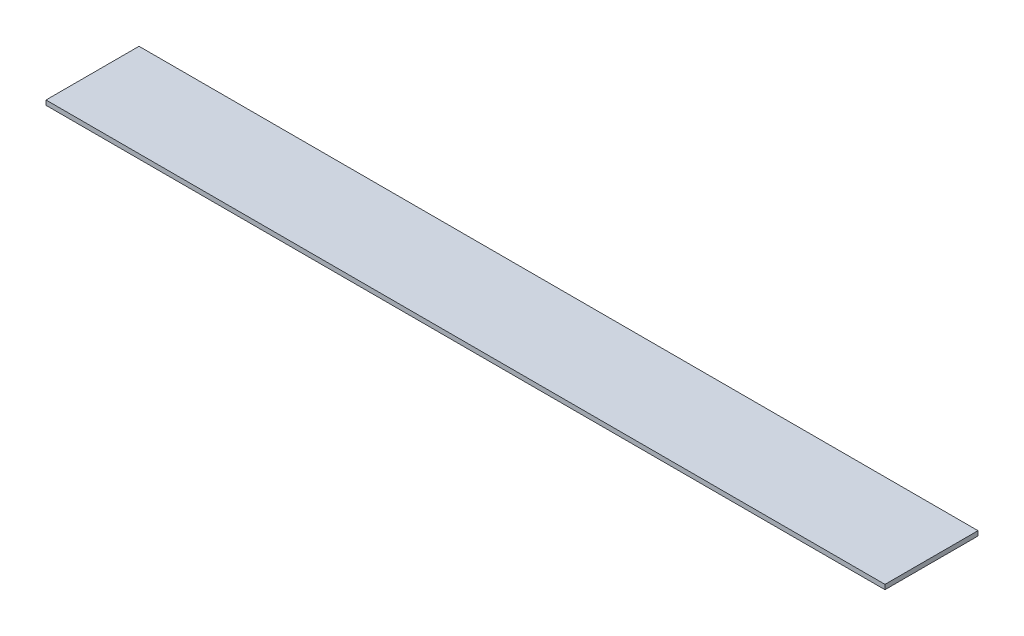
ISO-10303-21;
HEADER;
FILE_DESCRIPTION(('STEP AP214'),'2;1');
FILE_NAME('part.step','',(''),(''),'','','');
FILE_SCHEMA(('AUTOMOTIVE_DESIGN { 1 0 10303 214 1 1 1 1 }'));
ENDSEC;
DATA;
#1=APPLICATION_CONTEXT('core data for automotive mechanical design processes');
#2=APPLICATION_PROTOCOL_DEFINITION('international standard','automotive_design',2000,#1);
#3=PRODUCT_CONTEXT('',#1,'mechanical');
#4=PRODUCT('Part','Part','',(#3));
#5=PRODUCT_RELATED_PRODUCT_CATEGORY('part','',(#4));
#6=PRODUCT_DEFINITION_FORMATION('','',#4);
#7=PRODUCT_DEFINITION_CONTEXT('part definition',#1,'design');
#8=PRODUCT_DEFINITION('design','',#6,#7);
#9=PRODUCT_DEFINITION_SHAPE('','',#8);
#10=(LENGTH_UNIT() NAMED_UNIT(*) SI_UNIT(.MILLI.,.METRE.));
#11=(NAMED_UNIT(*) PLANE_ANGLE_UNIT() SI_UNIT($,.RADIAN.));
#12=(NAMED_UNIT(*) SI_UNIT($,.STERADIAN.) SOLID_ANGLE_UNIT());
#13=UNCERTAINTY_MEASURE_WITH_UNIT(LENGTH_MEASURE(1.E-05),#10,'distance_accuracy_value','');
#14=(GEOMETRIC_REPRESENTATION_CONTEXT(3) GLOBAL_UNCERTAINTY_ASSIGNED_CONTEXT((#13)) GLOBAL_UNIT_ASSIGNED_CONTEXT((#10,
#11,#12)) REPRESENTATION_CONTEXT('',''));
#15=CARTESIAN_POINT('',(0.,0.,0.));
#16=DIRECTION('',(0.,0.,1.));
#17=DIRECTION('',(1.,0.,0.));
#18=AXIS2_PLACEMENT_3D('',#15,#16,#17);
#19=CARTESIAN_POINT('',(-241.153214372562,46.99,0.));
#20=DIRECTION('',(1.,0.,0.));
#21=DIRECTION('',(0.,0.,-1.));
#22=AXIS2_PLACEMENT_3D('',#19,#20,#21);
#23=PLANE('',#22);
#24=DIRECTION('',(0.,1.,0.));
#25=VECTOR('',#24,1.);
#26=CARTESIAN_POINT('',(-241.153214372562,46.99,60.));
#27=LINE('',#26,#25);
#28=CARTESIAN_POINT('',(-241.153214372562,47.,60.));
#29=VERTEX_POINT('',#28);
#30=CARTESIAN_POINT('',(-241.153214372562,50.,60.));
#31=VERTEX_POINT('',#30);
#32=EDGE_CURVE('E38',#29,#31,#27,.T.);
#33=ORIENTED_EDGE('',*,*,#32,.T.);
#34=DIRECTION('',(0.,0.,1.));
#35=VECTOR('',#34,1.);
#36=CARTESIAN_POINT('',(-241.153214372562,50.,60.));
#37=LINE('',#36,#35);
#38=CARTESIAN_POINT('',(-241.153214372562,50.,0.));
#39=VERTEX_POINT('',#38);
#40=EDGE_CURVE('E78',#39,#31,#37,.T.);
#41=ORIENTED_EDGE('',*,*,#40,.F.);
#42=DIRECTION('',(0.,1.,0.));
#43=VECTOR('',#42,1.);
#44=CARTESIAN_POINT('',(-241.153214372562,46.99,0.));
#45=LINE('',#44,#43);
#46=CARTESIAN_POINT('',(-241.153214372562,47.,0.));
#47=VERTEX_POINT('',#46);
#48=EDGE_CURVE('E86',#47,#39,#45,.T.);
#49=ORIENTED_EDGE('',*,*,#48,.F.);
#50=DIRECTION('',(0.,0.,-1.));
#51=VECTOR('',#50,1.);
#52=CARTESIAN_POINT('',(-241.153214372562,47.,3.));
#53=LINE('',#52,#51);
#54=EDGE_CURVE('E87',#29,#47,#53,.T.);
#55=ORIENTED_EDGE('',*,*,#54,.F.);
#56=EDGE_LOOP('',(#33,#41,#49,#55));
#57=FACE_BOUND('',#56,.T.);
#58=ADVANCED_FACE('F34',(#57),#23,.F.);
#59=CARTESIAN_POINT('',(-300.,50.,60.));
#60=DIRECTION('',(0.,-1.,0.));
#61=DIRECTION('',(0.,0.,-1.));
#62=AXIS2_PLACEMENT_3D('',#59,#60,#61);
#63=PLANE('',#62);
#64=DIRECTION('',(-1.,0.,0.));
#65=VECTOR('',#64,1.);
#66=CARTESIAN_POINT('',(-300.,50.,0.));
#67=LINE('',#66,#65);
#68=CARTESIAN_POINT('',(300.,50.,0.));
#69=VERTEX_POINT('',#68);
#70=EDGE_CURVE('E83',#69,#39,#67,.T.);
#71=ORIENTED_EDGE('',*,*,#70,.T.);
#72=ORIENTED_EDGE('',*,*,#40,.T.);
#73=DIRECTION('',(-1.,0.,0.));
#74=VECTOR('',#73,1.);
#75=CARTESIAN_POINT('',(-300.,50.,60.));
#76=LINE('',#75,#74);
#77=CARTESIAN_POINT('',(300.,50.,60.));
#78=VERTEX_POINT('',#77);
#79=EDGE_CURVE('E43',#78,#31,#76,.T.);
#80=ORIENTED_EDGE('',*,*,#79,.F.);
#81=DIRECTION('',(0.,0.,-1.));
#82=VECTOR('',#81,1.);
#83=CARTESIAN_POINT('',(300.,50.,60.));
#84=LINE('',#83,#82);
#85=EDGE_CURVE('E50',#78,#69,#84,.T.);
#86=ORIENTED_EDGE('',*,*,#85,.T.);
#87=EDGE_LOOP('',(#71,#72,#80,#86));
#88=FACE_BOUND('',#87,.T.);
#89=ADVANCED_FACE('F80',(#88),#63,.F.);
#90=CARTESIAN_POINT('',(300.,1.71683972880179E-13,0.));
#91=DIRECTION('',(-1.,0.,0.));
#92=DIRECTION('',(0.,-1.,0.));
#93=AXIS2_PLACEMENT_3D('',#90,#91,#92);
#94=PLANE('',#93);
#95=ORIENTED_EDGE('',*,*,#85,.F.);
#96=DIRECTION('',(0.,-1.,0.));
#97=VECTOR('',#96,1.);
#98=CARTESIAN_POINT('',(300.,3.43367945760358E-13,60.));
#99=LINE('',#98,#97);
#100=CARTESIAN_POINT('',(300.,47.,60.));
#101=VERTEX_POINT('',#100);
#102=EDGE_CURVE('E11',#78,#101,#99,.T.);
#103=ORIENTED_EDGE('',*,*,#102,.T.);
#104=DIRECTION('',(0.,0.,1.));
#105=VECTOR('',#104,1.);
#106=CARTESIAN_POINT('',(300.,47.,3.));
#107=LINE('',#106,#105);
#108=CARTESIAN_POINT('',(300.,47.,0.));
#109=VERTEX_POINT('',#108);
#110=EDGE_CURVE('E58',#109,#101,#107,.T.);
#111=ORIENTED_EDGE('',*,*,#110,.F.);
#112=DIRECTION('',(0.,-1.,0.));
#113=VECTOR('',#112,1.);
#114=CARTESIAN_POINT('',(300.,3.43367945760358E-13,0.));
#115=LINE('',#114,#113);
#116=EDGE_CURVE('E97',#69,#109,#115,.T.);
#117=ORIENTED_EDGE('',*,*,#116,.F.);
#118=EDGE_LOOP('',(#95,#103,#111,#117));
#119=FACE_BOUND('',#118,.T.);
#120=ADVANCED_FACE('F121',(#119),#94,.F.);
#121=CARTESIAN_POINT('',(300.,47.,3.));
#122=DIRECTION('',(0.,1.,0.));
#123=DIRECTION('',(0.,0.,1.));
#124=AXIS2_PLACEMENT_3D('',#121,#122,#123);
#125=PLANE('',#124);
#126=DIRECTION('',(-1.,0.,0.));
#127=VECTOR('',#126,1.);
#128=CARTESIAN_POINT('',(300.,47.,60.));
#129=LINE('',#128,#127);
#130=EDGE_CURVE('E93',#101,#29,#129,.T.);
#131=ORIENTED_EDGE('',*,*,#130,.T.);
#132=ORIENTED_EDGE('',*,*,#54,.T.);
#133=DIRECTION('',(1.,0.,0.));
#134=VECTOR('',#133,1.);
#135=CARTESIAN_POINT('',(-300.,47.,0.));
#136=LINE('',#135,#134);
#137=EDGE_CURVE('E96',#47,#109,#136,.T.);
#138=ORIENTED_EDGE('',*,*,#137,.T.);
#139=ORIENTED_EDGE('',*,*,#110,.T.);
#140=EDGE_LOOP('',(#131,#132,#138,#139));
#141=FACE_BOUND('',#140,.T.);
#142=ADVANCED_FACE('F36',(#141),#125,.F.);
#143=CARTESIAN_POINT('',(-300.,0.,60.));
#144=DIRECTION('',(0.,0.,1.));
#145=DIRECTION('',(1.,0.,0.));
#146=AXIS2_PLACEMENT_3D('',#143,#144,#145);
#147=PLANE('',#146);
#148=ORIENTED_EDGE('',*,*,#32,.F.);
#149=ORIENTED_EDGE('',*,*,#130,.F.);
#150=ORIENTED_EDGE('',*,*,#102,.F.);
#151=ORIENTED_EDGE('',*,*,#79,.T.);
#152=EDGE_LOOP('',(#148,#149,#150,#151));
#153=FACE_BOUND('',#152,.T.);
#154=ADVANCED_FACE('F92',(#153),#147,.T.);
#155=CARTESIAN_POINT('',(-300.,0.,0.));
#156=DIRECTION('',(0.,0.,1.));
#157=DIRECTION('',(1.,0.,0.));
#158=AXIS2_PLACEMENT_3D('',#155,#156,#157);
#159=PLANE('',#158);
#160=ORIENTED_EDGE('',*,*,#137,.F.);
#161=ORIENTED_EDGE('',*,*,#48,.T.);
#162=ORIENTED_EDGE('',*,*,#70,.F.);
#163=ORIENTED_EDGE('',*,*,#116,.T.);
#164=EDGE_LOOP('',(#160,#161,#162,#163));
#165=FACE_BOUND('',#164,.T.);
#166=ADVANCED_FACE('F107',(#165),#159,.F.);
#167=CLOSED_SHELL('',(#58,#89,#120,#142,#154,#166));
#168=MANIFOLD_SOLID_BREP('B2',#167);
#169=ADVANCED_BREP_SHAPE_REPRESENTATION('',(#18,#168),#14);
#170=SHAPE_DEFINITION_REPRESENTATION(#9,#169);
ENDSEC;
END-ISO-10303-21;
